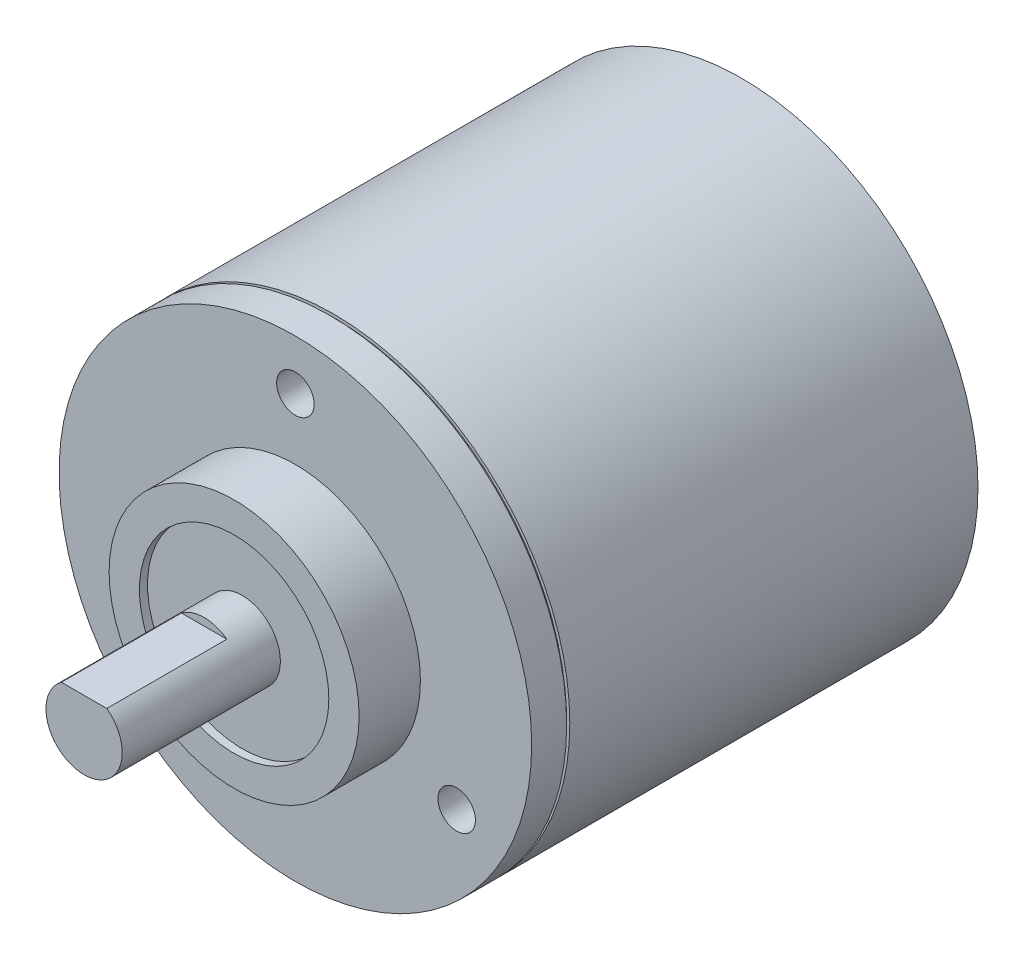
ISO-10303-21;
HEADER;
FILE_DESCRIPTION(('STEP AP214'),'2;1');
FILE_NAME('part.step','',(''),(''),'','','');
FILE_SCHEMA(('AUTOMOTIVE_DESIGN { 1 0 10303 214 1 1 1 1 }'));
ENDSEC;
DATA;
#1=APPLICATION_CONTEXT('core data for automotive mechanical design processes');
#2=APPLICATION_PROTOCOL_DEFINITION('international standard','automotive_design',2000,#1);
#3=PRODUCT_CONTEXT('',#1,'mechanical');
#4=PRODUCT('Part','Part','',(#3));
#5=PRODUCT_RELATED_PRODUCT_CATEGORY('part','',(#4));
#6=PRODUCT_DEFINITION_FORMATION('','',#4);
#7=PRODUCT_DEFINITION_CONTEXT('part definition',#1,'design');
#8=PRODUCT_DEFINITION('design','',#6,#7);
#9=PRODUCT_DEFINITION_SHAPE('','',#8);
#10=(LENGTH_UNIT() NAMED_UNIT(*) SI_UNIT(.MILLI.,.METRE.));
#11=(NAMED_UNIT(*) PLANE_ANGLE_UNIT() SI_UNIT($,.RADIAN.));
#12=(NAMED_UNIT(*) SI_UNIT($,.STERADIAN.) SOLID_ANGLE_UNIT());
#13=UNCERTAINTY_MEASURE_WITH_UNIT(LENGTH_MEASURE(1.E-05),#10,'distance_accuracy_value','');
#14=(GEOMETRIC_REPRESENTATION_CONTEXT(3) GLOBAL_UNCERTAINTY_ASSIGNED_CONTEXT((#13)) GLOBAL_UNIT_ASSIGNED_CONTEXT((#10,
#11,#12)) REPRESENTATION_CONTEXT('',''));
#15=CARTESIAN_POINT('',(0.,0.,0.));
#16=DIRECTION('',(0.,0.,1.));
#17=DIRECTION('',(1.,0.,0.));
#18=AXIS2_PLACEMENT_3D('',#15,#16,#17);
#19=CARTESIAN_POINT('',(0.,0.,-0.1));
#20=DIRECTION('',(0.,0.,1.));
#21=DIRECTION('',(1.,0.,0.));
#22=AXIS2_PLACEMENT_3D('',#19,#20,#21);
#23=CYLINDRICAL_SURFACE('',#22,18.9);
#24=CARTESIAN_POINT('',(0.,0.,32.8));
#25=DIRECTION('',(0.,0.,1.));
#26=DIRECTION('',(1.,0.,0.));
#27=AXIS2_PLACEMENT_3D('',#24,#25,#26);
#28=CIRCLE('',#27,18.9);
#29=CARTESIAN_POINT('',(18.9,0.,32.8));
#30=VERTEX_POINT('',#29);
#31=EDGE_CURVE('E43',#30,#30,#28,.F.);
#32=ORIENTED_EDGE('',*,*,#31,.F.);
#33=EDGE_LOOP('',(#32));
#34=FACE_BOUND('',#33,.T.);
#35=CARTESIAN_POINT('',(0.,0.,35.6));
#36=DIRECTION('',(0.,0.,1.));
#37=DIRECTION('',(1.,0.,0.));
#38=AXIS2_PLACEMENT_3D('',#35,#36,#37);
#39=CIRCLE('',#38,18.9);
#40=CARTESIAN_POINT('',(18.9,0.,35.6));
#41=VERTEX_POINT('',#40);
#42=EDGE_CURVE('E84',#41,#41,#39,.T.);
#43=ORIENTED_EDGE('',*,*,#42,.F.);
#44=EDGE_LOOP('',(#43));
#45=FACE_BOUND('',#44,.T.);
#46=ADVANCED_FACE('F39',(#34,#45),#23,.T.);
#47=CARTESIAN_POINT('',(0.,0.,35.6));
#48=DIRECTION('',(0.,0.,1.));
#49=DIRECTION('',(1.,0.,0.));
#50=AXIS2_PLACEMENT_3D('',#47,#48,#49);
#51=PLANE('',#50);
#52=CARTESIAN_POINT('',(-12.9037785163881,-7.45000000000006,35.6));
#53=DIRECTION('',(0.,0.,1.));
#54=DIRECTION('',(-0.500000000000004,0.866025403784436,0.));
#55=AXIS2_PLACEMENT_3D('',#52,#53,#54);
#56=CIRCLE('',#55,1.5);
#57=CARTESIAN_POINT('',(-13.6537785163881,-6.15096189432341,35.6));
#58=VERTEX_POINT('',#57);
#59=EDGE_CURVE('E117',#58,#58,#56,.T.);
#60=ORIENTED_EDGE('',*,*,#59,.F.);
#61=EDGE_LOOP('',(#60));
#62=FACE_BOUND('',#61,.T.);
#63=CARTESIAN_POINT('',(12.9037785163882,-7.44999999999988,35.6));
#64=DIRECTION('',(0.,0.,1.));
#65=DIRECTION('',(-0.499999999999992,-0.866025403784443,0.));
#66=AXIS2_PLACEMENT_3D('',#63,#64,#65);
#67=CIRCLE('',#66,1.5);
#68=CARTESIAN_POINT('',(12.1537785163882,-8.74903810567655,35.6));
#69=VERTEX_POINT('',#68);
#70=EDGE_CURVE('E106',#69,#69,#67,.T.);
#71=ORIENTED_EDGE('',*,*,#70,.F.);
#72=EDGE_LOOP('',(#71));
#73=FACE_BOUND('',#72,.T.);
#74=CARTESIAN_POINT('',(0.,14.9,35.6));
#75=DIRECTION('',(0.,0.,1.));
#76=DIRECTION('',(1.,0.,0.));
#77=AXIS2_PLACEMENT_3D('',#74,#75,#76);
#78=CIRCLE('',#77,1.5);
#79=CARTESIAN_POINT('',(1.5,14.9,35.6));
#80=VERTEX_POINT('',#79);
#81=EDGE_CURVE('E87',#80,#80,#78,.T.);
#82=ORIENTED_EDGE('',*,*,#81,.F.);
#83=EDGE_LOOP('',(#82));
#84=FACE_BOUND('',#83,.T.);
#85=CARTESIAN_POINT('',(0.,0.,35.6));
#86=DIRECTION('',(0.,0.,1.));
#87=DIRECTION('',(1.,0.,0.));
#88=AXIS2_PLACEMENT_3D('',#85,#86,#87);
#89=CIRCLE('',#88,10.);
#90=CARTESIAN_POINT('',(10.,0.,35.6));
#91=VERTEX_POINT('',#90);
#92=EDGE_CURVE('E91',#91,#91,#89,.T.);
#93=ORIENTED_EDGE('',*,*,#92,.F.);
#94=EDGE_LOOP('',(#93));
#95=FACE_BOUND('',#94,.T.);
#96=ORIENTED_EDGE('',*,*,#42,.T.);
#97=EDGE_LOOP('',(#96));
#98=FACE_BOUND('',#97,.T.);
#99=ADVANCED_FACE('F148',(#62,#73,#84,#95,#98),#51,.T.);
#100=CARTESIAN_POINT('',(0.,0.,40.5));
#101=DIRECTION('',(0.,0.,-1.));
#102=DIRECTION('',(-1.,0.,0.));
#103=AXIS2_PLACEMENT_3D('',#100,#101,#102);
#104=CYLINDRICAL_SURFACE('',#103,10.);
#105=CARTESIAN_POINT('',(0.,0.,40.5));
#106=DIRECTION('',(0.,0.,1.));
#107=DIRECTION('',(1.,0.,0.));
#108=AXIS2_PLACEMENT_3D('',#105,#106,#107);
#109=CIRCLE('',#108,10.);
#110=CARTESIAN_POINT('',(10.,0.,40.5));
#111=VERTEX_POINT('',#110);
#112=EDGE_CURVE('E80',#111,#111,#109,.T.);
#113=ORIENTED_EDGE('',*,*,#112,.F.);
#114=EDGE_LOOP('',(#113));
#115=FACE_BOUND('',#114,.T.);
#116=ORIENTED_EDGE('',*,*,#92,.T.);
#117=EDGE_LOOP('',(#116));
#118=FACE_BOUND('',#117,.T.);
#119=ADVANCED_FACE('F142',(#115,#118),#104,.T.);
#120=CARTESIAN_POINT('',(0.,0.,40.5));
#121=DIRECTION('',(0.,0.,1.));
#122=DIRECTION('',(1.,0.,0.));
#123=AXIS2_PLACEMENT_3D('',#120,#121,#122);
#124=PLANE('',#123);
#125=CARTESIAN_POINT('',(0.,0.,40.5));
#126=DIRECTION('',(0.,0.,1.));
#127=DIRECTION('',(1.,0.,0.));
#128=AXIS2_PLACEMENT_3D('',#125,#126,#127);
#129=CIRCLE('',#128,7.575);
#130=CARTESIAN_POINT('',(7.575,0.,40.5));
#131=VERTEX_POINT('',#130);
#132=EDGE_CURVE('E129',#131,#131,#129,.T.);
#133=ORIENTED_EDGE('',*,*,#132,.F.);
#134=EDGE_LOOP('',(#133));
#135=FACE_BOUND('',#134,.T.);
#136=ORIENTED_EDGE('',*,*,#112,.T.);
#137=EDGE_LOOP('',(#136));
#138=FACE_BOUND('',#137,.T.);
#139=ADVANCED_FACE('F138',(#135,#138),#124,.T.);
#140=CARTESIAN_POINT('',(0.,14.9,27.6));
#141=DIRECTION('',(0.,0.,1.));
#142=DIRECTION('',(1.,0.,0.));
#143=AXIS2_PLACEMENT_3D('',#140,#141,#142);
#144=CYLINDRICAL_SURFACE('',#143,1.5);
#145=CARTESIAN_POINT('',(0.,14.9,27.6));
#146=DIRECTION('',(0.,0.,1.));
#147=DIRECTION('',(1.,0.,0.));
#148=AXIS2_PLACEMENT_3D('',#145,#146,#147);
#149=CIRCLE('',#148,1.5);
#150=CARTESIAN_POINT('',(1.5,14.9,27.6));
#151=VERTEX_POINT('',#150);
#152=EDGE_CURVE('E81',#151,#151,#149,.T.);
#153=ORIENTED_EDGE('',*,*,#152,.F.);
#154=EDGE_LOOP('',(#153));
#155=FACE_BOUND('',#154,.T.);
#156=ORIENTED_EDGE('',*,*,#81,.T.);
#157=EDGE_LOOP('',(#156));
#158=FACE_BOUND('',#157,.T.);
#159=ADVANCED_FACE('F141',(#155,#158),#144,.F.);
#160=CARTESIAN_POINT('',(0.,14.9,27.6));
#161=DIRECTION('',(0.,0.,1.));
#162=DIRECTION('',(1.,0.,0.));
#163=AXIS2_PLACEMENT_3D('',#160,#161,#162);
#164=PLANE('',#163);
#165=ORIENTED_EDGE('',*,*,#152,.T.);
#166=EDGE_LOOP('',(#165));
#167=FACE_BOUND('',#166,.T.);
#168=ADVANCED_FACE('F186',(#167),#164,.T.);
#169=CARTESIAN_POINT('',(0.,0.,39.85));
#170=DIRECTION('',(0.,0.,1.));
#171=DIRECTION('',(1.,0.,0.));
#172=AXIS2_PLACEMENT_3D('',#169,#170,#171);
#173=CYLINDRICAL_SURFACE('',#172,7.575);
#174=CARTESIAN_POINT('',(0.,0.,39.85));
#175=DIRECTION('',(0.,0.,1.));
#176=DIRECTION('',(1.,0.,0.));
#177=AXIS2_PLACEMENT_3D('',#174,#175,#176);
#178=CIRCLE('',#177,7.575);
#179=CARTESIAN_POINT('',(7.575,0.,39.85));
#180=VERTEX_POINT('',#179);
#181=EDGE_CURVE('E130',#180,#180,#178,.T.);
#182=ORIENTED_EDGE('',*,*,#181,.F.);
#183=EDGE_LOOP('',(#182));
#184=FACE_BOUND('',#183,.T.);
#185=ORIENTED_EDGE('',*,*,#132,.T.);
#186=EDGE_LOOP('',(#185));
#187=FACE_BOUND('',#186,.T.);
#188=ADVANCED_FACE('F136',(#184,#187),#173,.F.);
#189=CARTESIAN_POINT('',(0.,0.,39.85));
#190=DIRECTION('',(0.,0.,1.));
#191=DIRECTION('',(1.,0.,0.));
#192=AXIS2_PLACEMENT_3D('',#189,#190,#191);
#193=PLANE('',#192);
#194=CARTESIAN_POINT('',(0.,0.,39.85));
#195=DIRECTION('',(0.,0.,1.));
#196=DIRECTION('',(1.,0.,0.));
#197=AXIS2_PLACEMENT_3D('',#194,#195,#196);
#198=CIRCLE('',#197,3.05);
#199=CARTESIAN_POINT('',(3.05,0.,39.85));
#200=VERTEX_POINT('',#199);
#201=EDGE_CURVE('E125',#200,#200,#198,.T.);
#202=ORIENTED_EDGE('',*,*,#201,.F.);
#203=EDGE_LOOP('',(#202));
#204=FACE_BOUND('',#203,.T.);
#205=ORIENTED_EDGE('',*,*,#181,.T.);
#206=EDGE_LOOP('',(#205));
#207=FACE_BOUND('',#206,.T.);
#208=ADVANCED_FACE('F183',(#204,#207),#193,.T.);
#209=CARTESIAN_POINT('',(0.,0.,52.5));
#210=DIRECTION('',(0.,0.,1.));
#211=DIRECTION('',(1.,0.,0.));
#212=AXIS2_PLACEMENT_3D('',#209,#210,#211);
#213=PLANE('',#212);
#214=DIRECTION('',(1.,0.,0.));
#215=VECTOR('',#214,1.);
#216=CARTESIAN_POINT('',(-4.31706966346971,2.45,52.5));
#217=LINE('',#216,#215);
#218=CARTESIAN_POINT('',(-1.81659021245849,2.45,52.5));
#219=VERTEX_POINT('',#218);
#220=CARTESIAN_POINT('',(1.81659021245849,2.45,52.5));
#221=VERTEX_POINT('',#220);
#222=EDGE_CURVE('E68',#219,#221,#217,.T.);
#223=ORIENTED_EDGE('',*,*,#222,.F.);
#224=CARTESIAN_POINT('',(0.,0.,52.5));
#225=DIRECTION('',(0.,0.,1.));
#226=DIRECTION('',(1.,0.,0.));
#227=AXIS2_PLACEMENT_3D('',#224,#225,#226);
#228=CIRCLE('',#227,3.05);
#229=EDGE_CURVE('E75',#219,#221,#228,.T.);
#230=ORIENTED_EDGE('',*,*,#229,.T.);
#231=EDGE_LOOP('',(#223,#230));
#232=FACE_BOUND('',#231,.T.);
#233=ADVANCED_FACE('F74',(#232),#213,.T.);
#234=CARTESIAN_POINT('',(0.,0.,52.5));
#235=DIRECTION('',(0.,0.,-1.));
#236=DIRECTION('',(-1.,0.,0.));
#237=AXIS2_PLACEMENT_3D('',#234,#235,#236);
#238=CYLINDRICAL_SURFACE('',#237,3.05);
#239=ORIENTED_EDGE('',*,*,#229,.F.);
#240=DIRECTION('',(0.,0.,-1.));
#241=VECTOR('',#240,1.);
#242=CARTESIAN_POINT('',(-1.81659021245849,2.45,52.5));
#243=LINE('',#242,#241);
#244=CARTESIAN_POINT('',(-1.81659021245849,2.45,42.9));
#245=VERTEX_POINT('',#244);
#246=EDGE_CURVE('E11',#219,#245,#243,.T.);
#247=ORIENTED_EDGE('',*,*,#246,.T.);
#248=CARTESIAN_POINT('',(0.,0.,42.9));
#249=DIRECTION('',(0.,0.,1.));
#250=DIRECTION('',(1.,0.,0.));
#251=AXIS2_PLACEMENT_3D('',#248,#249,#250);
#252=CIRCLE('',#251,3.05);
#253=CARTESIAN_POINT('',(1.81659021245849,2.45,42.9));
#254=VERTEX_POINT('',#253);
#255=EDGE_CURVE('E59',#254,#245,#252,.T.);
#256=ORIENTED_EDGE('',*,*,#255,.F.);
#257=DIRECTION('',(0.,0.,-1.));
#258=VECTOR('',#257,1.);
#259=CARTESIAN_POINT('',(1.81659021245849,2.45,52.5));
#260=LINE('',#259,#258);
#261=EDGE_CURVE('E48',#254,#221,#260,.F.);
#262=ORIENTED_EDGE('',*,*,#261,.T.);
#263=EDGE_LOOP('',(#239,#247,#256,#262));
#264=FACE_BOUND('',#263,.T.);
#265=ORIENTED_EDGE('',*,*,#201,.T.);
#266=EDGE_LOOP('',(#265));
#267=FACE_BOUND('',#266,.T.);
#268=ADVANCED_FACE('F78',(#264,#267),#238,.T.);
#269=CARTESIAN_POINT('',(-4.31706966346971,2.45,42.9));
#270=DIRECTION('',(0.,-1.,0.));
#271=DIRECTION('',(0.,0.,-1.));
#272=AXIS2_PLACEMENT_3D('',#269,#270,#271);
#273=PLANE('',#272);
#274=ORIENTED_EDGE('',*,*,#222,.T.);
#275=ORIENTED_EDGE('',*,*,#261,.F.);
#276=DIRECTION('',(1.,0.,0.));
#277=VECTOR('',#276,1.);
#278=CARTESIAN_POINT('',(-4.31706966346971,2.45,42.9));
#279=LINE('',#278,#277);
#280=EDGE_CURVE('E55',#245,#254,#279,.T.);
#281=ORIENTED_EDGE('',*,*,#280,.F.);
#282=ORIENTED_EDGE('',*,*,#246,.F.);
#283=EDGE_LOOP('',(#274,#275,#281,#282));
#284=FACE_BOUND('',#283,.T.);
#285=ADVANCED_FACE('F67',(#284),#273,.F.);
#286=CARTESIAN_POINT('',(0.,0.,42.9));
#287=DIRECTION('',(0.,0.,1.));
#288=DIRECTION('',(1.,0.,0.));
#289=AXIS2_PLACEMENT_3D('',#286,#287,#288);
#290=PLANE('',#289);
#291=ORIENTED_EDGE('',*,*,#255,.T.);
#292=ORIENTED_EDGE('',*,*,#280,.T.);
#293=EDGE_LOOP('',(#291,#292));
#294=FACE_BOUND('',#293,.T.);
#295=ADVANCED_FACE('F199',(#294),#290,.T.);
#296=CARTESIAN_POINT('',(12.9037785163882,-7.44999999999988,27.6));
#297=DIRECTION('',(0.,0.,1.));
#298=DIRECTION('',(1.,0.,0.));
#299=AXIS2_PLACEMENT_3D('',#296,#297,#298);
#300=CYLINDRICAL_SURFACE('',#299,1.5);
#301=CARTESIAN_POINT('',(12.9037785163882,-7.44999999999988,27.6));
#302=DIRECTION('',(0.,0.,1.));
#303=DIRECTION('',(-0.499999999999992,-0.866025403784443,0.));
#304=AXIS2_PLACEMENT_3D('',#301,#302,#303);
#305=CIRCLE('',#304,1.5);
#306=CARTESIAN_POINT('',(12.1537785163882,-8.74903810567655,27.6));
#307=VERTEX_POINT('',#306);
#308=EDGE_CURVE('E120',#307,#307,#305,.T.);
#309=ORIENTED_EDGE('',*,*,#308,.F.);
#310=EDGE_LOOP('',(#309));
#311=FACE_BOUND('',#310,.T.);
#312=ORIENTED_EDGE('',*,*,#70,.T.);
#313=EDGE_LOOP('',(#312));
#314=FACE_BOUND('',#313,.T.);
#315=ADVANCED_FACE('F202',(#311,#314),#300,.F.);
#316=CARTESIAN_POINT('',(12.9037785163882,-7.44999999999988,27.6));
#317=DIRECTION('',(0.,0.,1.));
#318=DIRECTION('',(-0.499999999999992,-0.866025403784443,0.));
#319=AXIS2_PLACEMENT_3D('',#316,#317,#318);
#320=PLANE('',#319);
#321=ORIENTED_EDGE('',*,*,#308,.T.);
#322=EDGE_LOOP('',(#321));
#323=FACE_BOUND('',#322,.T.);
#324=ADVANCED_FACE('F205',(#323),#320,.T.);
#325=CARTESIAN_POINT('',(-12.9037785163881,-7.45000000000006,27.6));
#326=DIRECTION('',(0.,0.,1.));
#327=DIRECTION('',(1.,0.,0.));
#328=AXIS2_PLACEMENT_3D('',#325,#326,#327);
#329=CYLINDRICAL_SURFACE('',#328,1.5);
#330=CARTESIAN_POINT('',(-12.9037785163881,-7.45000000000006,27.6));
#331=DIRECTION('',(0.,0.,1.));
#332=DIRECTION('',(-0.500000000000004,0.866025403784436,0.));
#333=AXIS2_PLACEMENT_3D('',#330,#331,#332);
#334=CIRCLE('',#333,1.5);
#335=CARTESIAN_POINT('',(-13.6537785163881,-6.15096189432341,27.6));
#336=VERTEX_POINT('',#335);
#337=EDGE_CURVE('E76',#336,#336,#334,.T.);
#338=ORIENTED_EDGE('',*,*,#337,.F.);
#339=EDGE_LOOP('',(#338));
#340=FACE_BOUND('',#339,.T.);
#341=ORIENTED_EDGE('',*,*,#59,.T.);
#342=EDGE_LOOP('',(#341));
#343=FACE_BOUND('',#342,.T.);
#344=ADVANCED_FACE('F209',(#340,#343),#329,.F.);
#345=CARTESIAN_POINT('',(-12.9037785163881,-7.45000000000006,27.6));
#346=DIRECTION('',(0.,0.,1.));
#347=DIRECTION('',(-0.500000000000004,0.866025403784436,0.));
#348=AXIS2_PLACEMENT_3D('',#345,#346,#347);
#349=PLANE('',#348);
#350=ORIENTED_EDGE('',*,*,#337,.T.);
#351=EDGE_LOOP('',(#350));
#352=FACE_BOUND('',#351,.T.);
#353=ADVANCED_FACE('F213',(#352),#349,.T.);
#354=CARTESIAN_POINT('',(0.,21.8461649379907,32.8));
#355=DIRECTION('',(0.,0.,1.));
#356=DIRECTION('',(1.,0.,0.));
#357=AXIS2_PLACEMENT_3D('',#354,#355,#356);
#358=PLANE('',#357);
#359=ORIENTED_EDGE('',*,*,#31,.T.);
#360=EDGE_LOOP('',(#359));
#361=FACE_BOUND('',#360,.T.);
#362=CARTESIAN_POINT('',(0.,0.,32.8));
#363=DIRECTION('',(0.,0.,-1.));
#364=DIRECTION('',(-1.,0.,0.));
#365=AXIS2_PLACEMENT_3D('',#362,#363,#364);
#366=CIRCLE('',#365,18.65);
#367=CARTESIAN_POINT('',(-18.65,0.,32.8));
#368=VERTEX_POINT('',#367);
#369=EDGE_CURVE('E102',#368,#368,#366,.T.);
#370=ORIENTED_EDGE('',*,*,#369,.F.);
#371=EDGE_LOOP('',(#370));
#372=FACE_BOUND('',#371,.T.);
#373=ADVANCED_FACE('F217',(#361,#372),#358,.F.);
#374=CARTESIAN_POINT('',(0.,0.,-0.1));
#375=DIRECTION('',(0.,0.,-1.));
#376=DIRECTION('',(-1.,0.,0.));
#377=AXIS2_PLACEMENT_3D('',#374,#375,#376);
#378=CYLINDRICAL_SURFACE('',#377,18.65);
#379=CARTESIAN_POINT('',(0.,0.,32.55));
#380=DIRECTION('',(0.,0.,-1.));
#381=DIRECTION('',(-1.,0.,0.));
#382=AXIS2_PLACEMENT_3D('',#379,#380,#381);
#383=CIRCLE('',#382,18.65);
#384=CARTESIAN_POINT('',(-18.65,0.,32.55));
#385=VERTEX_POINT('',#384);
#386=EDGE_CURVE('E108',#385,#385,#383,.T.);
#387=ORIENTED_EDGE('',*,*,#386,.F.);
#388=EDGE_LOOP('',(#387));
#389=FACE_BOUND('',#388,.T.);
#390=ORIENTED_EDGE('',*,*,#369,.T.);
#391=EDGE_LOOP('',(#390));
#392=FACE_BOUND('',#391,.T.);
#393=ADVANCED_FACE('F176',(#389,#392),#378,.T.);
#394=CARTESIAN_POINT('',(0.,21.8461649379907,32.55));
#395=DIRECTION('',(0.,0.,-1.));
#396=DIRECTION('',(-1.,0.,0.));
#397=AXIS2_PLACEMENT_3D('',#394,#395,#396);
#398=PLANE('',#397);
#399=CARTESIAN_POINT('',(0.,0.,32.55));
#400=DIRECTION('',(0.,0.,-1.));
#401=DIRECTION('',(-1.,0.,0.));
#402=AXIS2_PLACEMENT_3D('',#399,#400,#401);
#403=CIRCLE('',#402,18.9);
#404=CARTESIAN_POINT('',(-18.9,0.,32.55));
#405=VERTEX_POINT('',#404);
#406=EDGE_CURVE('E100',#405,#405,#403,.F.);
#407=ORIENTED_EDGE('',*,*,#406,.T.);
#408=EDGE_LOOP('',(#407));
#409=FACE_BOUND('',#408,.T.);
#410=ORIENTED_EDGE('',*,*,#386,.T.);
#411=EDGE_LOOP('',(#410));
#412=FACE_BOUND('',#411,.T.);
#413=ADVANCED_FACE('F169',(#409,#412),#398,.F.);
#414=CARTESIAN_POINT('',(0.,0.,-0.1));
#415=DIRECTION('',(0.,0.,1.));
#416=DIRECTION('',(1.,0.,0.));
#417=AXIS2_PLACEMENT_3D('',#414,#415,#416);
#418=PLANE('',#417);
#419=CARTESIAN_POINT('',(0.,0.,-0.1));
#420=DIRECTION('',(0.,0.,1.));
#421=DIRECTION('',(1.,0.,0.));
#422=AXIS2_PLACEMENT_3D('',#419,#420,#421);
#423=CIRCLE('',#422,18.9);
#424=CARTESIAN_POINT('',(18.9,0.,-0.1));
#425=VERTEX_POINT('',#424);
#426=EDGE_CURVE('E94',#425,#425,#423,.T.);
#427=ORIENTED_EDGE('',*,*,#426,.F.);
#428=EDGE_LOOP('',(#427));
#429=FACE_BOUND('',#428,.T.);
#430=ADVANCED_FACE('F164',(#429),#418,.F.);
#431=ORIENTED_EDGE('',*,*,#406,.F.);
#432=EDGE_LOOP('',(#431));
#433=FACE_BOUND('',#432,.T.);
#434=ORIENTED_EDGE('',*,*,#426,.T.);
#435=EDGE_LOOP('',(#434));
#436=FACE_BOUND('',#435,.T.);
#437=ADVANCED_FACE('F41',(#433,#436),#23,.T.);
#438=CLOSED_SHELL('',(#46,#99,#119,#139,#159,#168,#188,#208,#233,#268,#285,#295,#315,#324,#344,
#353,#373,#393,#413,#430,#437));
#439=MANIFOLD_SOLID_BREP('B2',#438);
#440=ADVANCED_BREP_SHAPE_REPRESENTATION('',(#18,#439),#14);
#441=SHAPE_DEFINITION_REPRESENTATION(#9,#440);
ENDSEC;
END-ISO-10303-21;
